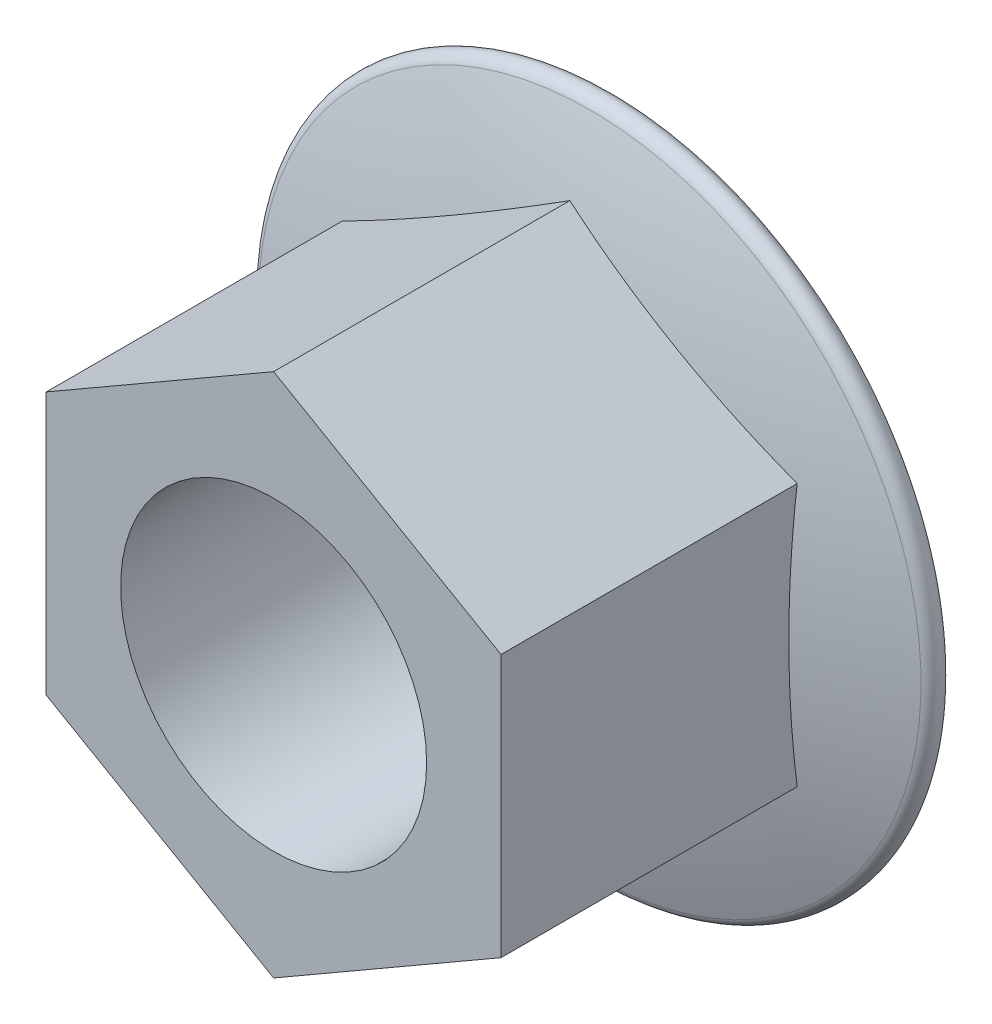
ISO-10303-21;
HEADER;
FILE_DESCRIPTION(('STEP AP214'),'2;1');
FILE_NAME('part.step','',(''),(''),'','','');
FILE_SCHEMA(('AUTOMOTIVE_DESIGN { 1 0 10303 214 1 1 1 1 }'));
ENDSEC;
DATA;
#1=APPLICATION_CONTEXT('core data for automotive mechanical design processes');
#2=APPLICATION_PROTOCOL_DEFINITION('international standard','automotive_design',2000,#1);
#3=PRODUCT_CONTEXT('',#1,'mechanical');
#4=PRODUCT('Part','Part','',(#3));
#5=PRODUCT_RELATED_PRODUCT_CATEGORY('part','',(#4));
#6=PRODUCT_DEFINITION_FORMATION('','',#4);
#7=PRODUCT_DEFINITION_CONTEXT('part definition',#1,'design');
#8=PRODUCT_DEFINITION('design','',#6,#7);
#9=PRODUCT_DEFINITION_SHAPE('','',#8);
#10=(LENGTH_UNIT() NAMED_UNIT(*) SI_UNIT(.MILLI.,.METRE.));
#11=(NAMED_UNIT(*) PLANE_ANGLE_UNIT() SI_UNIT($,.RADIAN.));
#12=(NAMED_UNIT(*) SI_UNIT($,.STERADIAN.) SOLID_ANGLE_UNIT());
#13=UNCERTAINTY_MEASURE_WITH_UNIT(LENGTH_MEASURE(1.E-05),#10,'distance_accuracy_value','');
#14=(GEOMETRIC_REPRESENTATION_CONTEXT(3) GLOBAL_UNCERTAINTY_ASSIGNED_CONTEXT((#13)) GLOBAL_UNIT_ASSIGNED_CONTEXT((#10,
#11,#12)) REPRESENTATION_CONTEXT('',''));
#15=CARTESIAN_POINT('',(0.,0.,0.));
#16=DIRECTION('',(0.,0.,1.));
#17=DIRECTION('',(1.,0.,0.));
#18=AXIS2_PLACEMENT_3D('',#15,#16,#17);
#19=CARTESIAN_POINT('',(-9.4360999999985,5.44793487510042,14.0970000000003));
#20=DIRECTION('',(-0.500000000000006,0.866025403784442,0.));
#21=DIRECTION('',(-0.866025403784439,-0.499999999999998,0.));
#22=AXIS2_PLACEMENT_3D('',#19,#20,#21);
#23=PLANE('',#22);
#24=DIRECTION('',(0.,0.,-1.00000000000002));
#25=VECTOR('',#24,1.);
#26=CARTESIAN_POINT('',(2.22044604925031E-13,10.8958697502013,14.0969999999998));
#27=LINE('',#26,#25);
#28=CARTESIAN_POINT('',(2.22044604925031E-13,10.8958697502013,14.0969999999998));
#29=VERTEX_POINT('',#28);
#30=CARTESIAN_POINT('',(4.21884749357559E-12,10.8958697502023,1.80579715631474));
#31=VERTEX_POINT('',#30);
#32=EDGE_CURVE('E100',#29,#31,#27,.T.);
#33=ORIENTED_EDGE('',*,*,#32,.T.);
#34=CARTESIAN_POINT('',(-4.71804999999792,8.17190231264911,-40.8632864367829));
#35=DIRECTION('',(-0.500000000000006,0.866025403784442,0.));
#36=DIRECTION('',(-0.866025403784439,-0.499999999999998,0.));
#37=AXIS2_PLACEMENT_3D('',#34,#35,#36);
#38=CIRCLE('',#37,43.0154703458886);
#39=CARTESIAN_POINT('',(-9.43610000000006,5.44793487510059,1.80579715631524));
#40=VERTEX_POINT('',#39);
#41=EDGE_CURVE('E44',#31,#40,#38,.F.);
#42=ORIENTED_EDGE('',*,*,#41,.T.);
#43=DIRECTION('',(0.,0.,-1.00000000000002));
#44=VECTOR('',#43,1.);
#45=CARTESIAN_POINT('',(-9.4360999999985,5.44793487510042,14.0970000000003));
#46=LINE('',#45,#44);
#47=CARTESIAN_POINT('',(-9.4360999999985,5.44793487510042,14.0970000000003));
#48=VERTEX_POINT('',#47);
#49=EDGE_CURVE('E37',#48,#40,#46,.T.);
#50=ORIENTED_EDGE('',*,*,#49,.F.);
#51=DIRECTION('',(0.866025403784439,0.499999999999998,0.));
#52=VECTOR('',#51,1.);
#53=CARTESIAN_POINT('',(-9.4360999999985,5.44793487510042,14.0970000000003));
#54=LINE('',#53,#52);
#55=EDGE_CURVE('E123',#48,#29,#54,.T.);
#56=ORIENTED_EDGE('',*,*,#55,.T.);
#57=EDGE_LOOP('',(#33,#42,#50,#56));
#58=FACE_BOUND('',#57,.T.);
#59=ADVANCED_FACE('F30',(#58),#23,.T.);
#60=CARTESIAN_POINT('',(-9.4360999999985,-5.44793487509931,14.0969999999994));
#61=DIRECTION('',(-1.,0.,0.));
#62=DIRECTION('',(0.,-1.,0.));
#63=AXIS2_PLACEMENT_3D('',#60,#61,#62);
#64=PLANE('',#63);
#65=ORIENTED_EDGE('',*,*,#49,.T.);
#66=CARTESIAN_POINT('',(-9.43610000000006,1.33226762955019E-12,-40.8632864367817));
#67=DIRECTION('',(-1.,0.,0.));
#68=DIRECTION('',(0.,-1.,0.));
#69=AXIS2_PLACEMENT_3D('',#66,#67,#68);
#70=CIRCLE('',#69,43.0154703458886);
#71=CARTESIAN_POINT('',(-9.43609999999873,-5.44793487509998,1.8057971563135));
#72=VERTEX_POINT('',#71);
#73=EDGE_CURVE('E126',#40,#72,#70,.F.);
#74=ORIENTED_EDGE('',*,*,#73,.T.);
#75=DIRECTION('',(0.,0.,-1.00000000000002));
#76=VECTOR('',#75,1.);
#77=CARTESIAN_POINT('',(-9.4360999999985,-5.44793487509931,14.0969999999994));
#78=LINE('',#77,#76);
#79=CARTESIAN_POINT('',(-9.4360999999985,-5.44793487509931,14.0969999999994));
#80=VERTEX_POINT('',#79);
#81=EDGE_CURVE('E108',#80,#72,#78,.T.);
#82=ORIENTED_EDGE('',*,*,#81,.F.);
#83=DIRECTION('',(0.,1.,0.));
#84=VECTOR('',#83,1.);
#85=CARTESIAN_POINT('',(-9.4360999999985,-5.44793487509931,14.0969999999994));
#86=LINE('',#85,#84);
#87=EDGE_CURVE('E104',#80,#48,#86,.T.);
#88=ORIENTED_EDGE('',*,*,#87,.T.);
#89=EDGE_LOOP('',(#65,#74,#82,#88));
#90=FACE_BOUND('',#89,.T.);
#91=ADVANCED_FACE('F154',(#90),#64,.T.);
#92=CARTESIAN_POINT('',(7.7715611723761E-12,-10.8958697502,14.0969999999993));
#93=DIRECTION('',(-0.5,-0.866025403784439,0.));
#94=DIRECTION('',(0.866025403784442,-0.500000000000006,0.));
#95=AXIS2_PLACEMENT_3D('',#92,#93,#94);
#96=PLANE('',#95);
#97=ORIENTED_EDGE('',*,*,#81,.T.);
#98=CARTESIAN_POINT('',(-4.71804999999681,-8.1719023126561,-40.8632864367834));
#99=DIRECTION('',(-0.5,-0.866025403784439,0.));
#100=DIRECTION('',(0.866025403784442,-0.500000000000006,0.));
#101=AXIS2_PLACEMENT_3D('',#98,#99,#100);
#102=CIRCLE('',#101,43.0154703458886);
#103=CARTESIAN_POINT('',(1.99840144432528E-12,-10.8958697501991,1.8057971563142));
#104=VERTEX_POINT('',#103);
#105=EDGE_CURVE('E129',#72,#104,#102,.F.);
#106=ORIENTED_EDGE('',*,*,#105,.T.);
#107=DIRECTION('',(0.,0.,-1.00000000000002));
#108=VECTOR('',#107,1.);
#109=CARTESIAN_POINT('',(7.7715611723761E-12,-10.8958697502,14.0969999999993));
#110=LINE('',#109,#108);
#111=CARTESIAN_POINT('',(7.7715611723761E-12,-10.8958697502,14.0969999999993));
#112=VERTEX_POINT('',#111);
#113=EDGE_CURVE('E102',#112,#104,#110,.T.);
#114=ORIENTED_EDGE('',*,*,#113,.F.);
#115=DIRECTION('',(-0.866025403784442,0.500000000000006,0.));
#116=VECTOR('',#115,1.);
#117=CARTESIAN_POINT('',(7.7715611723761E-12,-10.8958697502,14.0969999999993));
#118=LINE('',#117,#116);
#119=EDGE_CURVE('E114',#112,#80,#118,.T.);
#120=ORIENTED_EDGE('',*,*,#119,.T.);
#121=EDGE_LOOP('',(#97,#106,#114,#120));
#122=FACE_BOUND('',#121,.T.);
#123=ADVANCED_FACE('F156',(#122),#96,.T.);
#124=CARTESIAN_POINT('',(9.43610000000072,-5.44793487510073,14.0969999999996));
#125=DIRECTION('',(0.500000000000008,-0.866025403784446,0.));
#126=DIRECTION('',(0.866025403784439,0.499999999999998,0.));
#127=AXIS2_PLACEMENT_3D('',#124,#125,#126);
#128=PLANE('',#127);
#129=ORIENTED_EDGE('',*,*,#113,.T.);
#130=CARTESIAN_POINT('',(4.71805000000192,-8.17190231264908,-40.863286436784));
#131=DIRECTION('',(0.500000000000008,-0.866025403784446,0.));
#132=DIRECTION('',(0.866025403784439,0.499999999999998,0.));
#133=AXIS2_PLACEMENT_3D('',#130,#131,#132);
#134=CIRCLE('',#133,43.0154703458886);
#135=CARTESIAN_POINT('',(9.43610000000139,-5.44793487509804,1.80579715631414));
#136=VERTEX_POINT('',#135);
#137=EDGE_CURVE('E93',#104,#136,#134,.F.);
#138=ORIENTED_EDGE('',*,*,#137,.T.);
#139=DIRECTION('',(0.,0.,-1.00000000000002));
#140=VECTOR('',#139,1.);
#141=CARTESIAN_POINT('',(9.43610000000072,-5.44793487510073,14.0969999999996));
#142=LINE('',#141,#140);
#143=CARTESIAN_POINT('',(9.43610000000072,-5.44793487510073,14.0969999999996));
#144=VERTEX_POINT('',#143);
#145=EDGE_CURVE('E92',#144,#136,#142,.T.);
#146=ORIENTED_EDGE('',*,*,#145,.F.);
#147=DIRECTION('',(-0.866025403784439,-0.499999999999998,0.));
#148=VECTOR('',#147,1.);
#149=CARTESIAN_POINT('',(9.43610000000072,-5.44793487510073,14.0969999999996));
#150=LINE('',#149,#148);
#151=EDGE_CURVE('E117',#144,#112,#150,.T.);
#152=ORIENTED_EDGE('',*,*,#151,.T.);
#153=EDGE_LOOP('',(#129,#138,#146,#152));
#154=FACE_BOUND('',#153,.T.);
#155=ADVANCED_FACE('F159',(#154),#128,.T.);
#156=CARTESIAN_POINT('',(9.43609999999939,5.44793487510004,14.0969999999996));
#157=DIRECTION('',(1.00000000000001,0.,0.));
#158=DIRECTION('',(0.,0.999999999999999,0.));
#159=AXIS2_PLACEMENT_3D('',#156,#157,#158);
#160=PLANE('',#159);
#161=ORIENTED_EDGE('',*,*,#145,.T.);
#162=CARTESIAN_POINT('',(9.43610000000494,-5.55111512312578E-13,-40.8632864367828));
#163=DIRECTION('',(1.00000000000001,0.,0.));
#164=DIRECTION('',(0.,0.999999999999999,0.));
#165=AXIS2_PLACEMENT_3D('',#162,#163,#164);
#166=CIRCLE('',#165,43.0154703458886);
#167=CARTESIAN_POINT('',(9.43609999999961,5.44793487510106,1.80579715631454));
#168=VERTEX_POINT('',#167);
#169=EDGE_CURVE('E81',#136,#168,#166,.F.);
#170=ORIENTED_EDGE('',*,*,#169,.T.);
#171=DIRECTION('',(0.,0.,-1.00000000000002));
#172=VECTOR('',#171,1.);
#173=CARTESIAN_POINT('',(9.43609999999939,5.44793487510004,14.0969999999996));
#174=LINE('',#173,#172);
#175=CARTESIAN_POINT('',(9.43609999999939,5.44793487510004,14.0969999999996));
#176=VERTEX_POINT('',#175);
#177=EDGE_CURVE('E90',#176,#168,#174,.T.);
#178=ORIENTED_EDGE('',*,*,#177,.F.);
#179=DIRECTION('',(0.,-0.999999999999999,0.));
#180=VECTOR('',#179,1.);
#181=CARTESIAN_POINT('',(9.43609999999939,5.44793487510004,14.0969999999996));
#182=LINE('',#181,#180);
#183=EDGE_CURVE('E120',#176,#144,#182,.T.);
#184=ORIENTED_EDGE('',*,*,#183,.T.);
#185=EDGE_LOOP('',(#161,#170,#178,#184));
#186=FACE_BOUND('',#185,.T.);
#187=ADVANCED_FACE('F88',(#186),#160,.T.);
#188=CARTESIAN_POINT('',(2.22044604925031E-13,10.8958697502013,14.0969999999998));
#189=DIRECTION('',(0.5,0.866025403784439,0.));
#190=DIRECTION('',(-0.866025403784442,0.500000000000006,0.));
#191=AXIS2_PLACEMENT_3D('',#188,#189,#190);
#192=PLANE('',#191);
#193=ORIENTED_EDGE('',*,*,#177,.T.);
#194=CARTESIAN_POINT('',(4.71805000000347,8.17190231265058,-40.8632864367822));
#195=DIRECTION('',(0.5,0.866025403784439,0.));
#196=DIRECTION('',(-0.866025403784442,0.500000000000006,0.));
#197=AXIS2_PLACEMENT_3D('',#194,#195,#196);
#198=CIRCLE('',#197,43.0154703458886);
#199=EDGE_CURVE('E11',#168,#31,#198,.F.);
#200=ORIENTED_EDGE('',*,*,#199,.T.);
#201=ORIENTED_EDGE('',*,*,#32,.F.);
#202=DIRECTION('',(0.866025403784441,-0.500000000000006,0.));
#203=VECTOR('',#202,1.);
#204=CARTESIAN_POINT('',(2.22044604925031E-13,10.8958697502013,14.0969999999998));
#205=LINE('',#204,#203);
#206=EDGE_CURVE('E99',#29,#176,#205,.T.);
#207=ORIENTED_EDGE('',*,*,#206,.T.);
#208=EDGE_LOOP('',(#193,#200,#201,#207));
#209=FACE_BOUND('',#208,.T.);
#210=ADVANCED_FACE('F97',(#209),#192,.T.);
#211=CARTESIAN_POINT('',(-18.8721999999977,-1.38777878078145E-13,14.0970000000001));
#212=DIRECTION('',(0.,0.,1.00000000000002));
#213=DIRECTION('',(1.00000000000001,0.,0.));
#214=AXIS2_PLACEMENT_3D('',#211,#212,#213);
#215=PLANE('',#214);
#216=CARTESIAN_POINT('',(-6.66133814775094E-13,3.33066907387547E-13,14.096999999999));
#217=DIRECTION('',(0.,0.,1.00000000000002));
#218=DIRECTION('',(1.00000000000001,0.,0.));
#219=AXIS2_PLACEMENT_3D('',#216,#217,#218);
#220=CIRCLE('',#219,6.35);
#221=CARTESIAN_POINT('',(6.34999999999937,3.07510961139457E-13,14.096999999999));
#222=VERTEX_POINT('',#221);
#223=EDGE_CURVE('E141',#222,#222,#220,.T.);
#224=ORIENTED_EDGE('',*,*,#223,.F.);
#225=EDGE_LOOP('',(#224));
#226=FACE_BOUND('',#225,.T.);
#227=ORIENTED_EDGE('',*,*,#55,.F.);
#228=ORIENTED_EDGE('',*,*,#87,.F.);
#229=ORIENTED_EDGE('',*,*,#119,.F.);
#230=ORIENTED_EDGE('',*,*,#151,.F.);
#231=ORIENTED_EDGE('',*,*,#183,.F.);
#232=ORIENTED_EDGE('',*,*,#206,.F.);
#233=EDGE_LOOP('',(#227,#228,#229,#230,#231,#232));
#234=FACE_BOUND('',#233,.T.);
#235=ADVANCED_FACE('F147',(#226,#234),#215,.T.);
#236=CARTESIAN_POINT('',(1.33226762955019E-12,0.,-40.8632864367821));
#237=DIRECTION('',(0.,0.,-1.00000000000002));
#238=DIRECTION('',(-1.00000000000001,0.,0.));
#239=AXIS2_PLACEMENT_3D('',#236,#237,#238);
#240=SPHERICAL_SURFACE('',#239,44.0382864367816);
#241=ORIENTED_EDGE('',*,*,#41,.F.);
#242=ORIENTED_EDGE('',*,*,#199,.F.);
#243=ORIENTED_EDGE('',*,*,#169,.F.);
#244=ORIENTED_EDGE('',*,*,#137,.F.);
#245=ORIENTED_EDGE('',*,*,#105,.F.);
#246=ORIENTED_EDGE('',*,*,#73,.F.);
#247=EDGE_LOOP('',(#241,#242,#243,#244,#245,#246));
#248=FACE_BOUND('',#247,.T.);
#249=CARTESIAN_POINT('',(4.44089209850063E-13,9.15933995315754E-13,0.9750219843494));
#250=DIRECTION('',(0.,0.,-1.00000000000002));
#251=DIRECTION('',(-1.00000000000001,0.,0.));
#252=AXIS2_PLACEMENT_3D('',#249,#250,#251);
#253=CIRCLE('',#252,13.7450580481243);
#254=CARTESIAN_POINT('',(-13.7450580481239,9.678182670432E-13,0.975021984349395));
#255=VERTEX_POINT('',#254);
#256=EDGE_CURVE('E94',#255,#255,#253,.T.);
#257=ORIENTED_EDGE('',*,*,#256,.F.);
#258=EDGE_LOOP('',(#257));
#259=FACE_BOUND('',#258,.T.);
#260=ADVANCED_FACE('F79',(#248,#259),#240,.T.);
#261=CARTESIAN_POINT('',(3.77475828372553E-12,9.15933995315754E-13,0.49999999999871));
#262=DIRECTION('',(0.,0.,-1.00000000000002));
#263=DIRECTION('',(-1.00000000000001,0.,0.));
#264=AXIS2_PLACEMENT_3D('',#261,#262,#263);
#265=TOROIDAL_SURFACE('',#264,13.589,0.499999999999954);
#266=ORIENTED_EDGE('',*,*,#256,.T.);
#267=EDGE_LOOP('',(#266));
#268=FACE_BOUND('',#267,.T.);
#269=CARTESIAN_POINT('',(0.,0.,0.));
#270=DIRECTION('',(0.,0.,-1.00000000000002));
#271=DIRECTION('',(-1.00000000000001,0.,0.));
#272=AXIS2_PLACEMENT_3D('',#269,#270,#271);
#273=CIRCLE('',#272,13.589);
#274=CARTESIAN_POINT('',(-13.5890000000001,0.,0.));
#275=VERTEX_POINT('',#274);
#276=EDGE_CURVE('E135',#275,#275,#273,.T.);
#277=ORIENTED_EDGE('',*,*,#276,.F.);
#278=EDGE_LOOP('',(#277));
#279=FACE_BOUND('',#278,.T.);
#280=ADVANCED_FACE('F189',(#268,#279),#265,.T.);
#281=CARTESIAN_POINT('',(-18.8722000000012,1.27675647831893E-12,-2.08166817117217E-13));
#282=DIRECTION('',(0.,0.,1.00000000000002));
#283=DIRECTION('',(1.00000000000001,0.,0.));
#284=AXIS2_PLACEMENT_3D('',#281,#282,#283);
#285=PLANE('',#284);
#286=CARTESIAN_POINT('',(0.,0.,0.));
#287=DIRECTION('',(0.,0.,1.00000000000002));
#288=DIRECTION('',(1.00000000000001,0.,0.));
#289=AXIS2_PLACEMENT_3D('',#286,#287,#288);
#290=CIRCLE('',#289,6.35);
#291=CARTESIAN_POINT('',(6.35000000000004,0.,0.));
#292=VERTEX_POINT('',#291);
#293=EDGE_CURVE('E138',#292,#292,#290,.T.);
#294=ORIENTED_EDGE('',*,*,#293,.T.);
#295=EDGE_LOOP('',(#294));
#296=FACE_BOUND('',#295,.T.);
#297=ORIENTED_EDGE('',*,*,#276,.T.);
#298=EDGE_LOOP('',(#297));
#299=FACE_BOUND('',#298,.T.);
#300=ADVANCED_FACE('F179',(#296,#299),#285,.F.);
#301=CARTESIAN_POINT('',(0.,0.,0.));
#302=DIRECTION('',(0.,0.,1.00000000000002));
#303=DIRECTION('',(1.00000000000001,0.,0.));
#304=AXIS2_PLACEMENT_3D('',#301,#302,#303);
#305=CYLINDRICAL_SURFACE('',#304,6.35);
#306=ORIENTED_EDGE('',*,*,#293,.F.);
#307=EDGE_LOOP('',(#306));
#308=FACE_BOUND('',#307,.T.);
#309=ORIENTED_EDGE('',*,*,#223,.T.);
#310=EDGE_LOOP('',(#309));
#311=FACE_BOUND('',#310,.T.);
#312=ADVANCED_FACE('F145',(#308,#311),#305,.F.);
#313=CLOSED_SHELL('',(#59,#91,#123,#155,#187,#210,#235,#260,#280,#300,#312));
#314=MANIFOLD_SOLID_BREP('B2',#313);
#315=ADVANCED_BREP_SHAPE_REPRESENTATION('',(#18,#314),#14);
#316=SHAPE_DEFINITION_REPRESENTATION(#9,#315);
ENDSEC;
END-ISO-10303-21;
